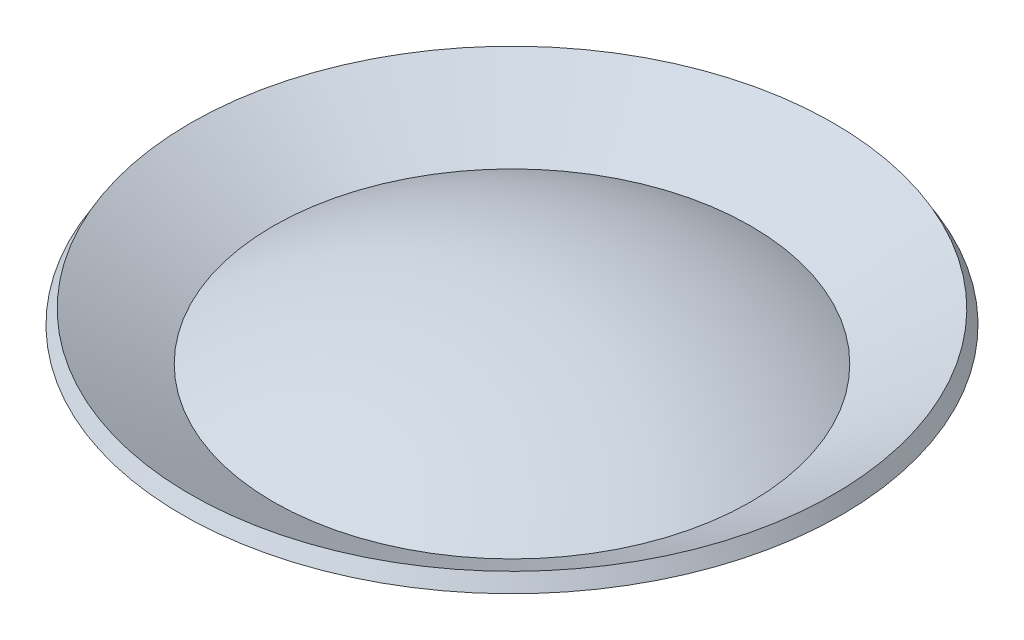
ISO-10303-21;
HEADER;
FILE_DESCRIPTION(('STEP AP214'),'2;1');
FILE_NAME('part.step','',(''),(''),'','','');
FILE_SCHEMA(('AUTOMOTIVE_DESIGN { 1 0 10303 214 1 1 1 1 }'));
ENDSEC;
DATA;
#1=APPLICATION_CONTEXT('core data for automotive mechanical design processes');
#2=APPLICATION_PROTOCOL_DEFINITION('international standard','automotive_design',2000,#1);
#3=PRODUCT_CONTEXT('',#1,'mechanical');
#4=PRODUCT('Part','Part','',(#3));
#5=PRODUCT_RELATED_PRODUCT_CATEGORY('part','',(#4));
#6=PRODUCT_DEFINITION_FORMATION('','',#4);
#7=PRODUCT_DEFINITION_CONTEXT('part definition',#1,'design');
#8=PRODUCT_DEFINITION('design','',#6,#7);
#9=PRODUCT_DEFINITION_SHAPE('','',#8);
#10=(LENGTH_UNIT() NAMED_UNIT(*) SI_UNIT(.MILLI.,.METRE.));
#11=(NAMED_UNIT(*) PLANE_ANGLE_UNIT() SI_UNIT($,.RADIAN.));
#12=(NAMED_UNIT(*) SI_UNIT($,.STERADIAN.) SOLID_ANGLE_UNIT());
#13=UNCERTAINTY_MEASURE_WITH_UNIT(LENGTH_MEASURE(1.E-05),#10,'distance_accuracy_value','');
#14=(GEOMETRIC_REPRESENTATION_CONTEXT(3) GLOBAL_UNCERTAINTY_ASSIGNED_CONTEXT((#13)) GLOBAL_UNIT_ASSIGNED_CONTEXT((#10,
#11,#12)) REPRESENTATION_CONTEXT('',''));
#15=CARTESIAN_POINT('',(0.,0.,0.));
#16=DIRECTION('',(0.,0.,1.));
#17=DIRECTION('',(1.,0.,0.));
#18=AXIS2_PLACEMENT_3D('',#15,#16,#17);
#19=CARTESIAN_POINT('',(0.,-30.,0.));
#20=DIRECTION('',(0.,1.,0.));
#21=DIRECTION('',(1.,0.,0.));
#22=AXIS2_PLACEMENT_3D('',#19,#20,#21);
#23=SPHERICAL_SURFACE('',#22,30.);
#24=CARTESIAN_POINT('',(0.,-4.01923788646684,0.));
#25=DIRECTION('',(0.,1.,0.));
#26=DIRECTION('',(-1.,0.,0.));
#27=AXIS2_PLACEMENT_3D('',#24,#25,#26);
#28=CIRCLE('',#27,15.);
#29=CARTESIAN_POINT('',(-15.,-4.01923788646684,0.));
#30=VERTEX_POINT('',#29);
#31=EDGE_CURVE('E10',#30,#30,#28,.T.);
#32=ORIENTED_EDGE('',*,*,#31,.T.);
#33=EDGE_LOOP('',(#32));
#34=FACE_BOUND('',#33,.T.);
#35=ADVANCED_FACE('F33',(#34),#23,.T.);
#36=CARTESIAN_POINT('',(0.,-1.01923788646685,0.));
#37=DIRECTION('',(0.,1.,0.));
#38=DIRECTION('',(-1.,0.,0.));
#39=AXIS2_PLACEMENT_3D('',#36,#37,#38);
#40=CONICAL_SURFACE('',#39,20.1961524227066,1.0471975511966);
#41=ORIENTED_EDGE('',*,*,#31,.F.);
#42=EDGE_LOOP('',(#41));
#43=FACE_BOUND('',#42,.T.);
#44=CARTESIAN_POINT('',(0.,-1.01923788646685,0.));
#45=DIRECTION('',(0.,1.,0.));
#46=DIRECTION('',(-1.,0.,0.));
#47=AXIS2_PLACEMENT_3D('',#44,#45,#46);
#48=CIRCLE('',#47,20.1961524227066);
#49=CARTESIAN_POINT('',(-20.1961524227066,-1.01923788646685,0.));
#50=VERTEX_POINT('',#49);
#51=EDGE_CURVE('E39',#50,#50,#48,.T.);
#52=ORIENTED_EDGE('',*,*,#51,.T.);
#53=EDGE_LOOP('',(#52));
#54=FACE_BOUND('',#53,.T.);
#55=ADVANCED_FACE('F65',(#43,#54),#40,.F.);
#56=CARTESIAN_POINT('',(0.,-1.88526329025129,0.));
#57=DIRECTION('',(0.,-1.,0.));
#58=DIRECTION('',(1.,0.,0.));
#59=AXIS2_PLACEMENT_3D('',#56,#57,#58);
#60=CONICAL_SURFACE('',#59,20.6961524227066,0.523598775598296);
#61=ORIENTED_EDGE('',*,*,#51,.F.);
#62=EDGE_LOOP('',(#61));
#63=FACE_BOUND('',#62,.T.);
#64=CARTESIAN_POINT('',(0.,-1.88526329025129,0.));
#65=DIRECTION('',(0.,1.,0.));
#66=DIRECTION('',(-1.,0.,0.));
#67=AXIS2_PLACEMENT_3D('',#64,#65,#66);
#68=CIRCLE('',#67,20.6961524227066);
#69=CARTESIAN_POINT('',(-20.6961524227066,-1.88526329025129,0.));
#70=VERTEX_POINT('',#69);
#71=EDGE_CURVE('E43',#70,#70,#68,.T.);
#72=ORIENTED_EDGE('',*,*,#71,.T.);
#73=EDGE_LOOP('',(#72));
#74=FACE_BOUND('',#73,.T.);
#75=ADVANCED_FACE('F61',(#63,#74),#60,.T.);
#76=CARTESIAN_POINT('',(0.,-5.17721924781756,0.));
#77=DIRECTION('',(0.,1.,0.));
#78=DIRECTION('',(-1.,0.,0.));
#79=AXIS2_PLACEMENT_3D('',#76,#77,#78);
#80=CONICAL_SURFACE('',#79,14.9943174479228,1.0471975511966);
#81=ORIENTED_EDGE('',*,*,#71,.F.);
#82=EDGE_LOOP('',(#81));
#83=FACE_BOUND('',#82,.T.);
#84=CARTESIAN_POINT('',(0.,-5.17721924781756,0.));
#85=DIRECTION('',(0.,1.,0.));
#86=DIRECTION('',(-1.,0.,0.));
#87=AXIS2_PLACEMENT_3D('',#84,#85,#86);
#88=CIRCLE('',#87,14.9943174479228);
#89=CARTESIAN_POINT('',(-14.9943174479228,-5.17721924781757,0.));
#90=VERTEX_POINT('',#89);
#91=EDGE_CURVE('E47',#90,#90,#88,.T.);
#92=ORIENTED_EDGE('',*,*,#91,.T.);
#93=EDGE_LOOP('',(#92));
#94=FACE_BOUND('',#93,.T.);
#95=ADVANCED_FACE('F53',(#83,#94),#80,.T.);
#96=CARTESIAN_POINT('',(0.,-30.,0.));
#97=DIRECTION('',(0.,1.,0.));
#98=DIRECTION('',(-1.,0.,0.));
#99=AXIS2_PLACEMENT_3D('',#96,#97,#98);
#100=SPHERICAL_SURFACE('',#99,29.);
#101=ORIENTED_EDGE('',*,*,#91,.F.);
#102=EDGE_LOOP('',(#101));
#103=FACE_BOUND('',#102,.T.);
#104=ADVANCED_FACE('F55',(#103),#100,.F.);
#105=CLOSED_SHELL('',(#35,#55,#75,#95,#104));
#106=MANIFOLD_SOLID_BREP('B2',#105);
#107=ADVANCED_BREP_SHAPE_REPRESENTATION('',(#18,#106),#14);
#108=SHAPE_DEFINITION_REPRESENTATION(#9,#107);
ENDSEC;
END-ISO-10303-21;
